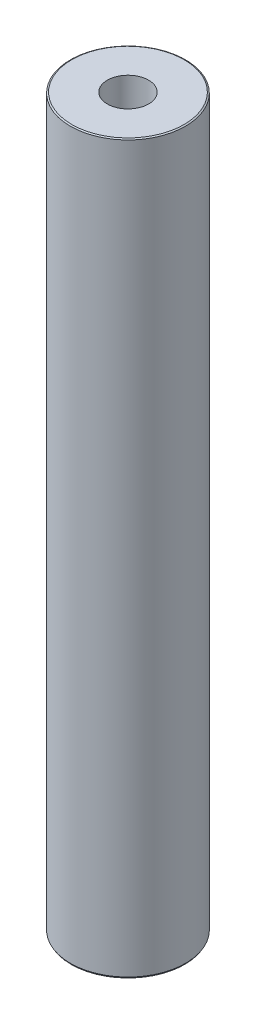
ISO-10303-21;
HEADER;
FILE_DESCRIPTION(('STEP AP214'),'2;1');
FILE_NAME('part.step','',(''),(''),'','','');
FILE_SCHEMA(('AUTOMOTIVE_DESIGN { 1 0 10303 214 1 1 1 1 }'));
ENDSEC;
DATA;
#1=APPLICATION_CONTEXT('core data for automotive mechanical design processes');
#2=APPLICATION_PROTOCOL_DEFINITION('international standard','automotive_design',2000,#1);
#3=PRODUCT_CONTEXT('',#1,'mechanical');
#4=PRODUCT('Part','Part','',(#3));
#5=PRODUCT_RELATED_PRODUCT_CATEGORY('part','',(#4));
#6=PRODUCT_DEFINITION_FORMATION('','',#4);
#7=PRODUCT_DEFINITION_CONTEXT('part definition',#1,'design');
#8=PRODUCT_DEFINITION('design','',#6,#7);
#9=PRODUCT_DEFINITION_SHAPE('','',#8);
#10=(LENGTH_UNIT() NAMED_UNIT(*) SI_UNIT(.MILLI.,.METRE.));
#11=(NAMED_UNIT(*) PLANE_ANGLE_UNIT() SI_UNIT($,.RADIAN.));
#12=(NAMED_UNIT(*) SI_UNIT($,.STERADIAN.) SOLID_ANGLE_UNIT());
#13=UNCERTAINTY_MEASURE_WITH_UNIT(LENGTH_MEASURE(1.E-05),#10,'distance_accuracy_value','');
#14=(GEOMETRIC_REPRESENTATION_CONTEXT(3) GLOBAL_UNCERTAINTY_ASSIGNED_CONTEXT((#13)) GLOBAL_UNIT_ASSIGNED_CONTEXT((#10,
#11,#12)) REPRESENTATION_CONTEXT('',''));
#15=CARTESIAN_POINT('',(0.,0.,0.));
#16=DIRECTION('',(0.,0.,1.));
#17=DIRECTION('',(1.,0.,0.));
#18=AXIS2_PLACEMENT_3D('',#15,#16,#17);
#19=CARTESIAN_POINT('',(0.,600.,0.));
#20=DIRECTION('',(0.,-1.,0.));
#21=DIRECTION('',(0.,0.,-1.));
#22=AXIS2_PLACEMENT_3D('',#19,#20,#21);
#23=CYLINDRICAL_SURFACE('',#22,47.5);
#24=CARTESIAN_POINT('',(0.,599.342958851145,0.));
#25=DIRECTION('',(0.,1.,0.));
#26=DIRECTION('',(0.,0.,1.));
#27=AXIS2_PLACEMENT_3D('',#24,#25,#26);
#28=CIRCLE('',#27,47.5);
#29=CARTESIAN_POINT('',(0.,599.342958851145,47.5));
#30=VERTEX_POINT('',#29);
#31=EDGE_CURVE('E50',#30,#30,#28,.F.);
#32=ORIENTED_EDGE('',*,*,#31,.T.);
#33=EDGE_LOOP('',(#32));
#34=FACE_BOUND('',#33,.T.);
#35=CARTESIAN_POINT('',(0.,1.13802865248058,0.));
#36=DIRECTION('',(0.,1.,0.));
#37=DIRECTION('',(0.,0.,1.));
#38=AXIS2_PLACEMENT_3D('',#35,#36,#37);
#39=CIRCLE('',#38,47.5);
#40=CARTESIAN_POINT('',(0.,1.13802865248058,47.5));
#41=VERTEX_POINT('',#40);
#42=EDGE_CURVE('E51',#41,#41,#39,.T.);
#43=ORIENTED_EDGE('',*,*,#42,.T.);
#44=EDGE_LOOP('',(#43));
#45=FACE_BOUND('',#44,.T.);
#46=ADVANCED_FACE('F39',(#34,#45),#23,.T.);
#47=CARTESIAN_POINT('',(0.,600.,0.));
#48=DIRECTION('',(0.,1.,0.));
#49=DIRECTION('',(0.,0.,1.));
#50=AXIS2_PLACEMENT_3D('',#47,#48,#49);
#51=PLANE('',#50);
#52=CARTESIAN_POINT('',(0.,600.,0.));
#53=DIRECTION('',(0.,1.,0.));
#54=DIRECTION('',(0.,0.,1.));
#55=AXIS2_PLACEMENT_3D('',#52,#53,#54);
#56=CIRCLE('',#55,46.3619713475196);
#57=CARTESIAN_POINT('',(0.,600.,46.3619713475196));
#58=VERTEX_POINT('',#57);
#59=EDGE_CURVE('E54',#58,#58,#56,.T.);
#60=ORIENTED_EDGE('',*,*,#59,.T.);
#61=EDGE_LOOP('',(#60));
#62=FACE_BOUND('',#61,.T.);
#63=CARTESIAN_POINT('',(0.,600.,0.));
#64=DIRECTION('',(0.,1.,0.));
#65=DIRECTION('',(0.,0.,1.));
#66=AXIS2_PLACEMENT_3D('',#63,#64,#65);
#67=CIRCLE('',#66,17.0577542458926);
#68=CARTESIAN_POINT('',(0.,600.,17.0577542458926));
#69=VERTEX_POINT('',#68);
#70=EDGE_CURVE('E58',#69,#69,#67,.T.);
#71=ORIENTED_EDGE('',*,*,#70,.F.);
#72=EDGE_LOOP('',(#71));
#73=FACE_BOUND('',#72,.T.);
#74=ADVANCED_FACE('F69',(#62,#73),#51,.T.);
#75=CARTESIAN_POINT('',(0.,0.,0.));
#76=DIRECTION('',(0.,1.,0.));
#77=DIRECTION('',(0.,0.,1.));
#78=AXIS2_PLACEMENT_3D('',#75,#76,#77);
#79=PLANE('',#78);
#80=CARTESIAN_POINT('',(0.,0.,0.));
#81=DIRECTION('',(0.,1.,0.));
#82=DIRECTION('',(0.,0.,1.));
#83=AXIS2_PLACEMENT_3D('',#80,#81,#82);
#84=CIRCLE('',#83,46.8429588511448);
#85=CARTESIAN_POINT('',(0.,0.,46.8429588511448));
#86=VERTEX_POINT('',#85);
#87=EDGE_CURVE('E10',#86,#86,#84,.F.);
#88=ORIENTED_EDGE('',*,*,#87,.T.);
#89=EDGE_LOOP('',(#88));
#90=FACE_BOUND('',#89,.T.);
#91=CARTESIAN_POINT('',(0.,0.,0.));
#92=DIRECTION('',(0.,1.,0.));
#93=DIRECTION('',(0.,0.,1.));
#94=AXIS2_PLACEMENT_3D('',#91,#92,#93);
#95=CIRCLE('',#94,17.0577542458926);
#96=CARTESIAN_POINT('',(0.,0.,17.0577542458926));
#97=VERTEX_POINT('',#96);
#98=EDGE_CURVE('E63',#97,#97,#95,.T.);
#99=ORIENTED_EDGE('',*,*,#98,.T.);
#100=EDGE_LOOP('',(#99));
#101=FACE_BOUND('',#100,.T.);
#102=ADVANCED_FACE('F75',(#90,#101),#79,.F.);
#103=CARTESIAN_POINT('',(0.,600.,0.));
#104=DIRECTION('',(0.,-1.,0.));
#105=DIRECTION('',(0.,0.,-1.));
#106=AXIS2_PLACEMENT_3D('',#103,#104,#105);
#107=CYLINDRICAL_SURFACE('',#106,17.0577542458926);
#108=ORIENTED_EDGE('',*,*,#70,.T.);
#109=EDGE_LOOP('',(#108));
#110=FACE_BOUND('',#109,.T.);
#111=ORIENTED_EDGE('',*,*,#98,.F.);
#112=EDGE_LOOP('',(#111));
#113=FACE_BOUND('',#112,.T.);
#114=ADVANCED_FACE('F70',(#110,#113),#107,.F.);
#115=CARTESIAN_POINT('',(0.,600.,0.));
#116=DIRECTION('',(0.,-1.,0.));
#117=DIRECTION('',(0.,0.,-1.));
#118=AXIS2_PLACEMENT_3D('',#115,#116,#117);
#119=CONICAL_SURFACE('',#118,46.3619713475196,1.04719755119663);
#120=ORIENTED_EDGE('',*,*,#31,.F.);
#121=EDGE_LOOP('',(#120));
#122=FACE_BOUND('',#121,.T.);
#123=ORIENTED_EDGE('',*,*,#59,.F.);
#124=EDGE_LOOP('',(#123));
#125=FACE_BOUND('',#124,.T.);
#126=ADVANCED_FACE('F81',(#122,#125),#119,.T.);
#127=CARTESIAN_POINT('',(0.,1.13802865248058,0.));
#128=DIRECTION('',(0.,1.,0.));
#129=DIRECTION('',(0.,0.,1.));
#130=AXIS2_PLACEMENT_3D('',#127,#128,#129);
#131=CONICAL_SURFACE('',#130,47.5,0.523598775598315);
#132=ORIENTED_EDGE('',*,*,#87,.F.);
#133=EDGE_LOOP('',(#132));
#134=FACE_BOUND('',#133,.T.);
#135=ORIENTED_EDGE('',*,*,#42,.F.);
#136=EDGE_LOOP('',(#135));
#137=FACE_BOUND('',#136,.T.);
#138=ADVANCED_FACE('F45',(#134,#137),#131,.T.);
#139=CLOSED_SHELL('',(#46,#74,#102,#114,#126,#138));
#140=MANIFOLD_SOLID_BREP('B2',#139);
#141=ADVANCED_BREP_SHAPE_REPRESENTATION('',(#18,#140),#14);
#142=SHAPE_DEFINITION_REPRESENTATION(#9,#141);
ENDSEC;
END-ISO-10303-21;
